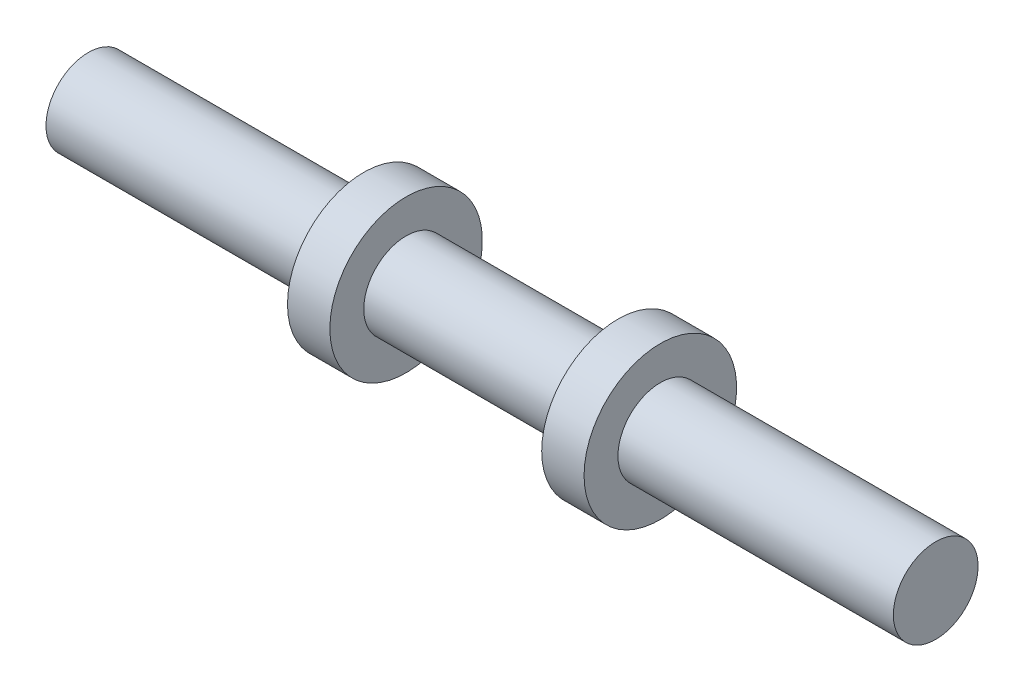
ISO-10303-21;
HEADER;
FILE_DESCRIPTION(('STEP AP214'),'2;1');
FILE_NAME('part.step','',(''),(''),'','','');
FILE_SCHEMA(('AUTOMOTIVE_DESIGN { 1 0 10303 214 1 1 1 1 }'));
ENDSEC;
DATA;
#1=APPLICATION_CONTEXT('core data for automotive mechanical design processes');
#2=APPLICATION_PROTOCOL_DEFINITION('international standard','automotive_design',2000,#1);
#3=PRODUCT_CONTEXT('',#1,'mechanical');
#4=PRODUCT('Part','Part','',(#3));
#5=PRODUCT_RELATED_PRODUCT_CATEGORY('part','',(#4));
#6=PRODUCT_DEFINITION_FORMATION('','',#4);
#7=PRODUCT_DEFINITION_CONTEXT('part definition',#1,'design');
#8=PRODUCT_DEFINITION('design','',#6,#7);
#9=PRODUCT_DEFINITION_SHAPE('','',#8);
#10=(LENGTH_UNIT() NAMED_UNIT(*) SI_UNIT(.MILLI.,.METRE.));
#11=(NAMED_UNIT(*) PLANE_ANGLE_UNIT() SI_UNIT($,.RADIAN.));
#12=(NAMED_UNIT(*) SI_UNIT($,.STERADIAN.) SOLID_ANGLE_UNIT());
#13=UNCERTAINTY_MEASURE_WITH_UNIT(LENGTH_MEASURE(1.E-05),#10,'distance_accuracy_value','');
#14=(GEOMETRIC_REPRESENTATION_CONTEXT(3) GLOBAL_UNCERTAINTY_ASSIGNED_CONTEXT((#13)) GLOBAL_UNIT_ASSIGNED_CONTEXT((#10,
#11,#12)) REPRESENTATION_CONTEXT('',''));
#15=CARTESIAN_POINT('',(0.,0.,0.));
#16=DIRECTION('',(0.,0.,1.));
#17=DIRECTION('',(1.,0.,0.));
#18=AXIS2_PLACEMENT_3D('',#15,#16,#17);
#19=CARTESIAN_POINT('',(0.,0.,0.));
#20=DIRECTION('',(1.,0.,0.));
#21=DIRECTION('',(0.,0.,-1.));
#22=AXIS2_PLACEMENT_3D('',#19,#20,#21);
#23=PLANE('',#22);
#24=CARTESIAN_POINT('',(0.,0.,0.));
#25=DIRECTION('',(-1.,0.,0.));
#26=DIRECTION('',(0.,0.,1.));
#27=AXIS2_PLACEMENT_3D('',#24,#25,#26);
#28=CIRCLE('',#27,1.);
#29=CARTESIAN_POINT('',(0.,0.,1.));
#30=VERTEX_POINT('',#29);
#31=EDGE_CURVE('E63',#30,#30,#28,.T.);
#32=ORIENTED_EDGE('',*,*,#31,.T.);
#33=EDGE_LOOP('',(#32));
#34=FACE_BOUND('',#33,.T.);
#35=ADVANCED_FACE('F36',(#34),#23,.F.);
#36=CARTESIAN_POINT('',(20.,0.,0.));
#37=DIRECTION('',(-1.,0.,0.));
#38=DIRECTION('',(0.,0.,1.));
#39=AXIS2_PLACEMENT_3D('',#36,#37,#38);
#40=CYLINDRICAL_SURFACE('',#39,1.8);
#41=CARTESIAN_POINT('',(13.5,0.,0.));
#42=DIRECTION('',(-1.,0.,0.));
#43=DIRECTION('',(0.,0.,1.));
#44=AXIS2_PLACEMENT_3D('',#41,#42,#43);
#45=CIRCLE('',#44,1.8);
#46=CARTESIAN_POINT('',(13.5,0.,1.8));
#47=VERTEX_POINT('',#46);
#48=EDGE_CURVE('E44',#47,#47,#45,.T.);
#49=ORIENTED_EDGE('',*,*,#48,.T.);
#50=EDGE_LOOP('',(#49));
#51=FACE_BOUND('',#50,.T.);
#52=CARTESIAN_POINT('',(12.5,0.,0.));
#53=DIRECTION('',(1.,0.,0.));
#54=DIRECTION('',(0.,0.,1.));
#55=AXIS2_PLACEMENT_3D('',#52,#53,#54);
#56=CIRCLE('',#55,1.8);
#57=CARTESIAN_POINT('',(12.5,0.,1.8));
#58=VERTEX_POINT('',#57);
#59=EDGE_CURVE('E50',#58,#58,#56,.T.);
#60=ORIENTED_EDGE('',*,*,#59,.T.);
#61=EDGE_LOOP('',(#60));
#62=FACE_BOUND('',#61,.T.);
#63=ADVANCED_FACE('F85',(#51,#62),#40,.T.);
#64=CARTESIAN_POINT('',(20.,0.,0.));
#65=DIRECTION('',(1.,0.,0.));
#66=DIRECTION('',(0.,0.,-1.));
#67=AXIS2_PLACEMENT_3D('',#64,#65,#66);
#68=PLANE('',#67);
#69=CARTESIAN_POINT('',(20.,0.,0.));
#70=DIRECTION('',(-1.,0.,0.));
#71=DIRECTION('',(0.,0.,1.));
#72=AXIS2_PLACEMENT_3D('',#69,#70,#71);
#73=CIRCLE('',#72,1.);
#74=CARTESIAN_POINT('',(20.,0.,1.));
#75=VERTEX_POINT('',#74);
#76=EDGE_CURVE('E40',#75,#75,#73,.T.);
#77=ORIENTED_EDGE('',*,*,#76,.F.);
#78=EDGE_LOOP('',(#77));
#79=FACE_BOUND('',#78,.T.);
#80=ADVANCED_FACE('F90',(#79),#68,.T.);
#81=CARTESIAN_POINT('',(6.5,0.,0.));
#82=DIRECTION('',(-1.,0.,0.));
#83=DIRECTION('',(0.,0.,1.));
#84=AXIS2_PLACEMENT_3D('',#81,#82,#83);
#85=CIRCLE('',#84,1.8);
#86=CARTESIAN_POINT('',(6.5,0.,1.8));
#87=VERTEX_POINT('',#86);
#88=EDGE_CURVE('E57',#87,#87,#85,.T.);
#89=ORIENTED_EDGE('',*,*,#88,.F.);
#90=EDGE_LOOP('',(#89));
#91=FACE_BOUND('',#90,.T.);
#92=CARTESIAN_POINT('',(7.5,0.,0.));
#93=DIRECTION('',(1.,0.,0.));
#94=DIRECTION('',(0.,0.,1.));
#95=AXIS2_PLACEMENT_3D('',#92,#93,#94);
#96=CIRCLE('',#95,1.8);
#97=CARTESIAN_POINT('',(7.5,0.,1.8));
#98=VERTEX_POINT('',#97);
#99=EDGE_CURVE('E58',#98,#98,#96,.T.);
#100=ORIENTED_EDGE('',*,*,#99,.F.);
#101=EDGE_LOOP('',(#100));
#102=FACE_BOUND('',#101,.T.);
#103=ADVANCED_FACE('F38',(#91,#102),#40,.T.);
#104=CARTESIAN_POINT('',(13.5,0.,0.));
#105=DIRECTION('',(1.,0.,0.));
#106=DIRECTION('',(0.,0.,-1.));
#107=AXIS2_PLACEMENT_3D('',#104,#105,#106);
#108=CYLINDRICAL_SURFACE('',#107,1.);
#109=ORIENTED_EDGE('',*,*,#76,.T.);
#110=EDGE_LOOP('',(#109));
#111=FACE_BOUND('',#110,.T.);
#112=CARTESIAN_POINT('',(13.5,0.,0.));
#113=DIRECTION('',(-1.,0.,0.));
#114=DIRECTION('',(0.,0.,1.));
#115=AXIS2_PLACEMENT_3D('',#112,#113,#114);
#116=CIRCLE('',#115,1.);
#117=CARTESIAN_POINT('',(13.5,0.,1.));
#118=VERTEX_POINT('',#117);
#119=EDGE_CURVE('E10',#118,#118,#116,.T.);
#120=ORIENTED_EDGE('',*,*,#119,.F.);
#121=EDGE_LOOP('',(#120));
#122=FACE_BOUND('',#121,.T.);
#123=ADVANCED_FACE('F96',(#111,#122),#108,.T.);
#124=CARTESIAN_POINT('',(13.5,0.,0.));
#125=DIRECTION('',(-1.,0.,0.));
#126=DIRECTION('',(0.,0.,1.));
#127=AXIS2_PLACEMENT_3D('',#124,#125,#126);
#128=PLANE('',#127);
#129=ORIENTED_EDGE('',*,*,#48,.F.);
#130=EDGE_LOOP('',(#129));
#131=FACE_BOUND('',#130,.T.);
#132=ORIENTED_EDGE('',*,*,#119,.T.);
#133=EDGE_LOOP('',(#132));
#134=FACE_BOUND('',#133,.T.);
#135=ADVANCED_FACE('F99',(#131,#134),#128,.F.);
#136=CARTESIAN_POINT('',(7.5,0.,0.));
#137=DIRECTION('',(1.,0.,0.));
#138=DIRECTION('',(0.,0.,-1.));
#139=AXIS2_PLACEMENT_3D('',#136,#137,#138);
#140=CYLINDRICAL_SURFACE('',#139,1.);
#141=CARTESIAN_POINT('',(12.5,0.,0.));
#142=DIRECTION('',(-1.,0.,0.));
#143=DIRECTION('',(0.,0.,1.));
#144=AXIS2_PLACEMENT_3D('',#141,#142,#143);
#145=CIRCLE('',#144,1.);
#146=CARTESIAN_POINT('',(12.5,0.,1.));
#147=VERTEX_POINT('',#146);
#148=EDGE_CURVE('E54',#147,#147,#145,.T.);
#149=ORIENTED_EDGE('',*,*,#148,.T.);
#150=EDGE_LOOP('',(#149));
#151=FACE_BOUND('',#150,.T.);
#152=CARTESIAN_POINT('',(7.5,0.,0.));
#153=DIRECTION('',(-1.,0.,0.));
#154=DIRECTION('',(0.,0.,1.));
#155=AXIS2_PLACEMENT_3D('',#152,#153,#154);
#156=CIRCLE('',#155,1.);
#157=CARTESIAN_POINT('',(7.5,0.,1.));
#158=VERTEX_POINT('',#157);
#159=EDGE_CURVE('E53',#158,#158,#156,.T.);
#160=ORIENTED_EDGE('',*,*,#159,.F.);
#161=EDGE_LOOP('',(#160));
#162=FACE_BOUND('',#161,.T.);
#163=ADVANCED_FACE('F103',(#151,#162),#140,.T.);
#164=CARTESIAN_POINT('',(7.5,0.,0.));
#165=DIRECTION('',(-1.,0.,0.));
#166=DIRECTION('',(0.,0.,1.));
#167=AXIS2_PLACEMENT_3D('',#164,#165,#166);
#168=PLANE('',#167);
#169=ORIENTED_EDGE('',*,*,#99,.T.);
#170=EDGE_LOOP('',(#169));
#171=FACE_BOUND('',#170,.T.);
#172=ORIENTED_EDGE('',*,*,#159,.T.);
#173=EDGE_LOOP('',(#172));
#174=FACE_BOUND('',#173,.T.);
#175=ADVANCED_FACE('F107',(#171,#174),#168,.F.);
#176=CARTESIAN_POINT('',(12.5,0.,0.));
#177=DIRECTION('',(-1.,0.,0.));
#178=DIRECTION('',(0.,0.,1.));
#179=AXIS2_PLACEMENT_3D('',#176,#177,#178);
#180=PLANE('',#179);
#181=ORIENTED_EDGE('',*,*,#59,.F.);
#182=EDGE_LOOP('',(#181));
#183=FACE_BOUND('',#182,.T.);
#184=ORIENTED_EDGE('',*,*,#148,.F.);
#185=EDGE_LOOP('',(#184));
#186=FACE_BOUND('',#185,.T.);
#187=ADVANCED_FACE('F81',(#183,#186),#180,.T.);
#188=CARTESIAN_POINT('',(6.5,0.,0.));
#189=DIRECTION('',(-1.,0.,0.));
#190=DIRECTION('',(0.,0.,1.));
#191=AXIS2_PLACEMENT_3D('',#188,#189,#190);
#192=CYLINDRICAL_SURFACE('',#191,1.);
#193=ORIENTED_EDGE('',*,*,#31,.F.);
#194=EDGE_LOOP('',(#193));
#195=FACE_BOUND('',#194,.T.);
#196=CARTESIAN_POINT('',(6.5,0.,0.));
#197=DIRECTION('',(-1.,0.,0.));
#198=DIRECTION('',(0.,0.,1.));
#199=AXIS2_PLACEMENT_3D('',#196,#197,#198);
#200=CIRCLE('',#199,1.);
#201=CARTESIAN_POINT('',(6.5,0.,1.));
#202=VERTEX_POINT('',#201);
#203=EDGE_CURVE('E66',#202,#202,#200,.T.);
#204=ORIENTED_EDGE('',*,*,#203,.T.);
#205=EDGE_LOOP('',(#204));
#206=FACE_BOUND('',#205,.T.);
#207=ADVANCED_FACE('F72',(#195,#206),#192,.T.);
#208=CARTESIAN_POINT('',(6.5,0.,0.));
#209=DIRECTION('',(1.,0.,0.));
#210=DIRECTION('',(0.,0.,1.));
#211=AXIS2_PLACEMENT_3D('',#208,#209,#210);
#212=PLANE('',#211);
#213=ORIENTED_EDGE('',*,*,#88,.T.);
#214=EDGE_LOOP('',(#213));
#215=FACE_BOUND('',#214,.T.);
#216=ORIENTED_EDGE('',*,*,#203,.F.);
#217=EDGE_LOOP('',(#216));
#218=FACE_BOUND('',#217,.T.);
#219=ADVANCED_FACE('F74',(#215,#218),#212,.F.);
#220=CLOSED_SHELL('',(#35,#63,#80,#103,#123,#135,#163,#175,#187,#207,#219));
#221=MANIFOLD_SOLID_BREP('B2',#220);
#222=ADVANCED_BREP_SHAPE_REPRESENTATION('',(#18,#221),#14);
#223=SHAPE_DEFINITION_REPRESENTATION(#9,#222);
ENDSEC;
END-ISO-10303-21;
